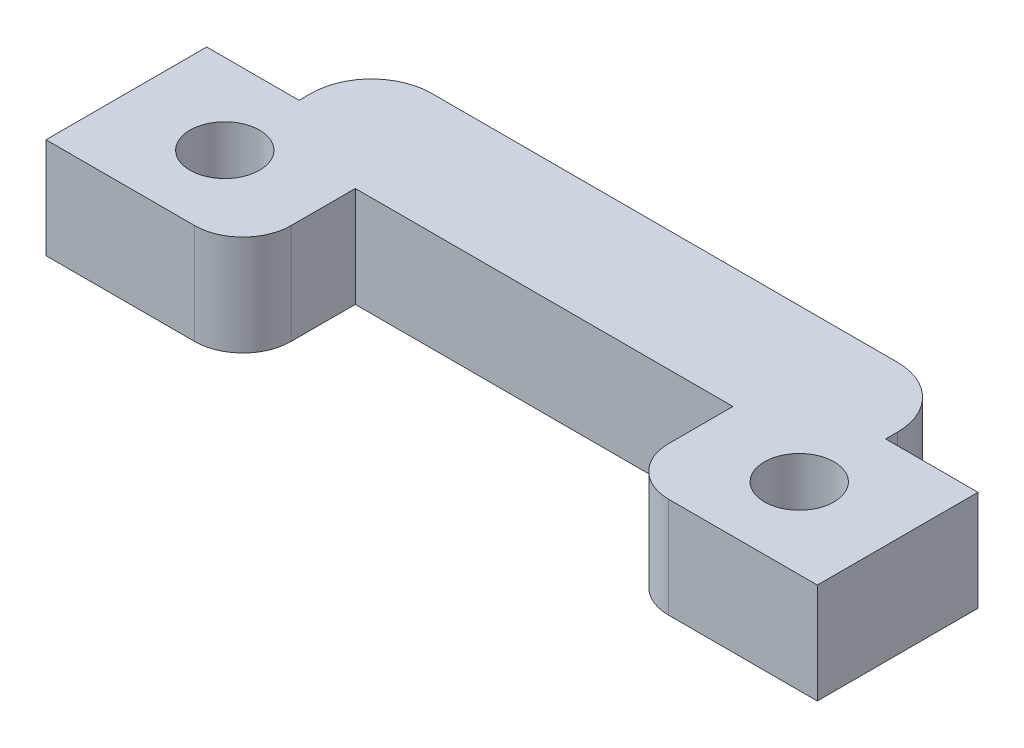
ISO-10303-21;
HEADER;
FILE_DESCRIPTION(('STEP AP214'),'2;1');
FILE_NAME('part.step','',(''),(''),'','','');
FILE_SCHEMA(('AUTOMOTIVE_DESIGN { 1 0 10303 214 1 1 1 1 }'));
ENDSEC;
DATA;
#1=APPLICATION_CONTEXT('core data for automotive mechanical design processes');
#2=APPLICATION_PROTOCOL_DEFINITION('international standard','automotive_design',2000,#1);
#3=PRODUCT_CONTEXT('',#1,'mechanical');
#4=PRODUCT('Part','Part','',(#3));
#5=PRODUCT_RELATED_PRODUCT_CATEGORY('part','',(#4));
#6=PRODUCT_DEFINITION_FORMATION('','',#4);
#7=PRODUCT_DEFINITION_CONTEXT('part definition',#1,'design');
#8=PRODUCT_DEFINITION('design','',#6,#7);
#9=PRODUCT_DEFINITION_SHAPE('','',#8);
#10=(LENGTH_UNIT() NAMED_UNIT(*) SI_UNIT(.MILLI.,.METRE.));
#11=(NAMED_UNIT(*) PLANE_ANGLE_UNIT() SI_UNIT($,.RADIAN.));
#12=(NAMED_UNIT(*) SI_UNIT($,.STERADIAN.) SOLID_ANGLE_UNIT());
#13=UNCERTAINTY_MEASURE_WITH_UNIT(LENGTH_MEASURE(1.E-05),#10,'distance_accuracy_value','');
#14=(GEOMETRIC_REPRESENTATION_CONTEXT(3) GLOBAL_UNCERTAINTY_ASSIGNED_CONTEXT((#13)) GLOBAL_UNIT_ASSIGNED_CONTEXT((#10,
#11,#12)) REPRESENTATION_CONTEXT('',''));
#15=CARTESIAN_POINT('',(0.,0.,0.));
#16=DIRECTION('',(0.,0.,1.));
#17=DIRECTION('',(1.,0.,0.));
#18=AXIS2_PLACEMENT_3D('',#15,#16,#17);
#19=CARTESIAN_POINT('',(0.,3.175,-7.23880944748787));
#20=DIRECTION('',(1.,0.,0.));
#21=DIRECTION('',(0.,0.,-1.));
#22=AXIS2_PLACEMENT_3D('',#19,#20,#21);
#23=PLANE('',#22);
#24=DIRECTION('',(0.,0.,1.));
#25=VECTOR('',#24,1.);
#26=CARTESIAN_POINT('',(0.,3.175,-7.23880944748787));
#27=LINE('',#26,#25);
#28=CARTESIAN_POINT('',(0.,3.175,-4.95280944748787));
#29=VERTEX_POINT('',#28);
#30=CARTESIAN_POINT('',(0.,3.175,0.127190552512133));
#31=VERTEX_POINT('',#30);
#32=EDGE_CURVE('E200',#29,#31,#27,.T.);
#33=ORIENTED_EDGE('',*,*,#32,.F.);
#34=DIRECTION('',(0.,-1.,0.));
#35=VECTOR('',#34,1.);
#36=CARTESIAN_POINT('',(0.,3.175,-4.95280944748787));
#37=LINE('',#36,#35);
#38=CARTESIAN_POINT('',(0.,0.,-4.95280944748787));
#39=VERTEX_POINT('',#38);
#40=EDGE_CURVE('E265',#29,#39,#37,.T.);
#41=ORIENTED_EDGE('',*,*,#40,.T.);
#42=DIRECTION('',(0.,0.,1.));
#43=VECTOR('',#42,1.);
#44=CARTESIAN_POINT('',(0.,0.,-7.23880944748787));
#45=LINE('',#44,#43);
#46=CARTESIAN_POINT('',(0.,0.,0.127190552512133));
#47=VERTEX_POINT('',#46);
#48=EDGE_CURVE('E180',#39,#47,#45,.T.);
#49=ORIENTED_EDGE('',*,*,#48,.T.);
#50=DIRECTION('',(0.,-1.,0.));
#51=VECTOR('',#50,1.);
#52=CARTESIAN_POINT('',(0.,3.175,0.127190552512133));
#53=LINE('',#52,#51);
#54=EDGE_CURVE('E220',#31,#47,#53,.T.);
#55=ORIENTED_EDGE('',*,*,#54,.F.);
#56=EDGE_LOOP('',(#33,#41,#49,#55));
#57=FACE_BOUND('',#56,.T.);
#58=ADVANCED_FACE('F32',(#57),#23,.F.);
#59=CARTESIAN_POINT('',(0.,3.175,0.127190552512133));
#60=DIRECTION('',(0.,0.,-1.));
#61=DIRECTION('',(-1.,0.,0.));
#62=AXIS2_PLACEMENT_3D('',#59,#60,#61);
#63=PLANE('',#62);
#64=DIRECTION('',(1.,0.,0.));
#65=VECTOR('',#64,1.);
#66=CARTESIAN_POINT('',(0.,0.,0.127190552512133));
#67=LINE('',#66,#65);
#68=CARTESIAN_POINT('',(4.69899999999999,0.,0.127190552512133));
#69=VERTEX_POINT('',#68);
#70=EDGE_CURVE('E182',#47,#69,#67,.T.);
#71=ORIENTED_EDGE('',*,*,#70,.T.);
#72=DIRECTION('',(0.,-1.,0.));
#73=VECTOR('',#72,1.);
#74=CARTESIAN_POINT('',(4.69899999999999,3.175,0.127190552512133));
#75=LINE('',#74,#73);
#76=CARTESIAN_POINT('',(4.69899999999999,3.175,0.127190552512133));
#77=VERTEX_POINT('',#76);
#78=EDGE_CURVE('E217',#77,#69,#75,.T.);
#79=ORIENTED_EDGE('',*,*,#78,.F.);
#80=DIRECTION('',(1.,0.,0.));
#81=VECTOR('',#80,1.);
#82=CARTESIAN_POINT('',(0.,3.175,0.127190552512133));
#83=LINE('',#82,#81);
#84=EDGE_CURVE('E288',#31,#77,#83,.T.);
#85=ORIENTED_EDGE('',*,*,#84,.F.);
#86=ORIENTED_EDGE('',*,*,#54,.T.);
#87=EDGE_LOOP('',(#71,#79,#85,#86));
#88=FACE_BOUND('',#87,.T.);
#89=ADVANCED_FACE('F330',(#88),#63,.F.);
#90=CARTESIAN_POINT('',(4.69899999999999,3.175,-1.39680944748787));
#91=DIRECTION('',(0.,-1.,0.));
#92=DIRECTION('',(0.,0.,-1.));
#93=AXIS2_PLACEMENT_3D('',#90,#91,#92);
#94=CYLINDRICAL_SURFACE('',#93,1.524);
#95=CARTESIAN_POINT('',(4.69899999999999,0.,-1.39680944748787));
#96=DIRECTION('',(0.,1.,0.));
#97=DIRECTION('',(0.,0.,1.));
#98=AXIS2_PLACEMENT_3D('',#95,#96,#97);
#99=CIRCLE('',#98,1.524);
#100=CARTESIAN_POINT('',(6.22299999999999,0.,-1.39680944748787));
#101=VERTEX_POINT('',#100);
#102=EDGE_CURVE('E185',#69,#101,#99,.T.);
#103=ORIENTED_EDGE('',*,*,#102,.T.);
#104=DIRECTION('',(0.,-1.,0.));
#105=VECTOR('',#104,1.);
#106=CARTESIAN_POINT('',(6.22299999999999,3.175,-1.39680944748787));
#107=LINE('',#106,#105);
#108=CARTESIAN_POINT('',(6.22299999999999,3.175,-1.39680944748787));
#109=VERTEX_POINT('',#108);
#110=EDGE_CURVE('E214',#109,#101,#107,.T.);
#111=ORIENTED_EDGE('',*,*,#110,.F.);
#112=CARTESIAN_POINT('',(4.69899999999999,3.175,-1.39680944748787));
#113=DIRECTION('',(0.,1.,0.));
#114=DIRECTION('',(0.,0.,1.));
#115=AXIS2_PLACEMENT_3D('',#112,#113,#114);
#116=CIRCLE('',#115,1.524);
#117=EDGE_CURVE('E290',#77,#109,#116,.T.);
#118=ORIENTED_EDGE('',*,*,#117,.F.);
#119=ORIENTED_EDGE('',*,*,#78,.T.);
#120=EDGE_LOOP('',(#103,#111,#118,#119));
#121=FACE_BOUND('',#120,.T.);
#122=ADVANCED_FACE('F325',(#121),#94,.T.);
#123=CARTESIAN_POINT('',(6.22299999999999,3.175,-3.42880944748787));
#124=DIRECTION('',(-1.,0.,0.));
#125=DIRECTION('',(0.,0.,1.));
#126=AXIS2_PLACEMENT_3D('',#123,#124,#125);
#127=PLANE('',#126);
#128=DIRECTION('',(0.,0.,-1.));
#129=VECTOR('',#128,1.);
#130=CARTESIAN_POINT('',(6.22299999999999,0.,-3.42880944748787));
#131=LINE('',#130,#129);
#132=CARTESIAN_POINT('',(6.22299999999999,0.,-3.42880944748787));
#133=VERTEX_POINT('',#132);
#134=EDGE_CURVE('E187',#101,#133,#131,.T.);
#135=ORIENTED_EDGE('',*,*,#134,.T.);
#136=DIRECTION('',(0.,-1.,0.));
#137=VECTOR('',#136,1.);
#138=CARTESIAN_POINT('',(6.22299999999999,3.175,-3.42880944748787));
#139=LINE('',#138,#137);
#140=CARTESIAN_POINT('',(6.22299999999999,3.175,-3.42880944748787));
#141=VERTEX_POINT('',#140);
#142=EDGE_CURVE('E211',#141,#133,#139,.T.);
#143=ORIENTED_EDGE('',*,*,#142,.F.);
#144=DIRECTION('',(0.,0.,-1.));
#145=VECTOR('',#144,1.);
#146=CARTESIAN_POINT('',(6.22299999999999,3.175,-3.42880944748787));
#147=LINE('',#146,#145);
#148=EDGE_CURVE('E292',#109,#141,#147,.T.);
#149=ORIENTED_EDGE('',*,*,#148,.F.);
#150=ORIENTED_EDGE('',*,*,#110,.T.);
#151=EDGE_LOOP('',(#135,#143,#149,#150));
#152=FACE_BOUND('',#151,.T.);
#153=ADVANCED_FACE('F319',(#152),#127,.F.);
#154=CARTESIAN_POINT('',(18.161,3.175,-3.42880944748787));
#155=DIRECTION('',(0.,0.,-1.));
#156=DIRECTION('',(-1.,0.,0.));
#157=AXIS2_PLACEMENT_3D('',#154,#155,#156);
#158=PLANE('',#157);
#159=DIRECTION('',(1.,0.,0.));
#160=VECTOR('',#159,1.);
#161=CARTESIAN_POINT('',(18.161,0.,-3.42880944748787));
#162=LINE('',#161,#160);
#163=CARTESIAN_POINT('',(18.161,0.,-3.42880944748787));
#164=VERTEX_POINT('',#163);
#165=EDGE_CURVE('E189',#133,#164,#162,.T.);
#166=ORIENTED_EDGE('',*,*,#165,.T.);
#167=DIRECTION('',(0.,-1.,0.));
#168=VECTOR('',#167,1.);
#169=CARTESIAN_POINT('',(18.161,3.175,-3.42880944748787));
#170=LINE('',#169,#168);
#171=CARTESIAN_POINT('',(18.161,3.175,-3.42880944748787));
#172=VERTEX_POINT('',#171);
#173=EDGE_CURVE('E208',#172,#164,#170,.T.);
#174=ORIENTED_EDGE('',*,*,#173,.F.);
#175=DIRECTION('',(1.,0.,0.));
#176=VECTOR('',#175,1.);
#177=CARTESIAN_POINT('',(18.161,3.175,-3.42880944748787));
#178=LINE('',#177,#176);
#179=EDGE_CURVE('E294',#141,#172,#178,.T.);
#180=ORIENTED_EDGE('',*,*,#179,.F.);
#181=ORIENTED_EDGE('',*,*,#142,.T.);
#182=EDGE_LOOP('',(#166,#174,#180,#181));
#183=FACE_BOUND('',#182,.T.);
#184=ADVANCED_FACE('F315',(#183),#158,.F.);
#185=CARTESIAN_POINT('',(18.161,3.175,-1.39680944748787));
#186=DIRECTION('',(1.,0.,0.));
#187=DIRECTION('',(0.,0.,-1.));
#188=AXIS2_PLACEMENT_3D('',#185,#186,#187);
#189=PLANE('',#188);
#190=DIRECTION('',(0.,0.,1.));
#191=VECTOR('',#190,1.);
#192=CARTESIAN_POINT('',(18.161,0.,-1.39680944748787));
#193=LINE('',#192,#191);
#194=CARTESIAN_POINT('',(18.161,0.,-1.39680944748787));
#195=VERTEX_POINT('',#194);
#196=EDGE_CURVE('E191',#164,#195,#193,.T.);
#197=ORIENTED_EDGE('',*,*,#196,.T.);
#198=DIRECTION('',(0.,-1.,0.));
#199=VECTOR('',#198,1.);
#200=CARTESIAN_POINT('',(18.161,3.175,-1.39680944748787));
#201=LINE('',#200,#199);
#202=CARTESIAN_POINT('',(18.161,3.175,-1.39680944748787));
#203=VERTEX_POINT('',#202);
#204=EDGE_CURVE('E205',#203,#195,#201,.T.);
#205=ORIENTED_EDGE('',*,*,#204,.F.);
#206=DIRECTION('',(0.,0.,1.));
#207=VECTOR('',#206,1.);
#208=CARTESIAN_POINT('',(18.161,3.175,-1.39680944748787));
#209=LINE('',#208,#207);
#210=EDGE_CURVE('E296',#172,#203,#209,.T.);
#211=ORIENTED_EDGE('',*,*,#210,.F.);
#212=ORIENTED_EDGE('',*,*,#173,.T.);
#213=EDGE_LOOP('',(#197,#205,#211,#212));
#214=FACE_BOUND('',#213,.T.);
#215=ADVANCED_FACE('F311',(#214),#189,.F.);
#216=CARTESIAN_POINT('',(19.685,3.175,-1.39680944748787));
#217=DIRECTION('',(0.,-1.,0.));
#218=DIRECTION('',(0.,0.,-1.));
#219=AXIS2_PLACEMENT_3D('',#216,#217,#218);
#220=CYLINDRICAL_SURFACE('',#219,1.524);
#221=CARTESIAN_POINT('',(19.685,0.,-1.39680944748787));
#222=DIRECTION('',(0.,1.,0.));
#223=DIRECTION('',(0.,0.,1.));
#224=AXIS2_PLACEMENT_3D('',#221,#222,#223);
#225=CIRCLE('',#224,1.524);
#226=CARTESIAN_POINT('',(19.685,0.,0.127190552512133));
#227=VERTEX_POINT('',#226);
#228=EDGE_CURVE('E193',#195,#227,#225,.T.);
#229=ORIENTED_EDGE('',*,*,#228,.T.);
#230=DIRECTION('',(0.,-1.,0.));
#231=VECTOR('',#230,1.);
#232=CARTESIAN_POINT('',(19.685,3.175,0.127190552512133));
#233=LINE('',#232,#231);
#234=CARTESIAN_POINT('',(19.685,3.175,0.127190552512133));
#235=VERTEX_POINT('',#234);
#236=EDGE_CURVE('E202',#235,#227,#233,.T.);
#237=ORIENTED_EDGE('',*,*,#236,.F.);
#238=CARTESIAN_POINT('',(19.685,3.175,-1.39680944748787));
#239=DIRECTION('',(0.,1.,0.));
#240=DIRECTION('',(0.,0.,1.));
#241=AXIS2_PLACEMENT_3D('',#238,#239,#240);
#242=CIRCLE('',#241,1.524);
#243=EDGE_CURVE('E176',#203,#235,#242,.T.);
#244=ORIENTED_EDGE('',*,*,#243,.F.);
#245=ORIENTED_EDGE('',*,*,#204,.T.);
#246=EDGE_LOOP('',(#229,#237,#244,#245));
#247=FACE_BOUND('',#246,.T.);
#248=ADVANCED_FACE('F302',(#247),#220,.T.);
#249=CARTESIAN_POINT('',(19.685,3.175,0.127190552512133));
#250=DIRECTION('',(0.,0.,-1.));
#251=DIRECTION('',(-1.,0.,0.));
#252=AXIS2_PLACEMENT_3D('',#249,#250,#251);
#253=PLANE('',#252);
#254=DIRECTION('',(1.,0.,0.));
#255=VECTOR('',#254,1.);
#256=CARTESIAN_POINT('',(19.685,0.,0.127190552512133));
#257=LINE('',#256,#255);
#258=CARTESIAN_POINT('',(24.384,0.,0.127190552512133));
#259=VERTEX_POINT('',#258);
#260=EDGE_CURVE('E195',#227,#259,#257,.T.);
#261=ORIENTED_EDGE('',*,*,#260,.T.);
#262=DIRECTION('',(0.,-1.,0.));
#263=VECTOR('',#262,1.);
#264=CARTESIAN_POINT('',(24.384,3.175,0.127190552512133));
#265=LINE('',#264,#263);
#266=CARTESIAN_POINT('',(24.384,3.175,0.127190552512133));
#267=VERTEX_POINT('',#266);
#268=EDGE_CURVE('E174',#267,#259,#265,.T.);
#269=ORIENTED_EDGE('',*,*,#268,.F.);
#270=DIRECTION('',(1.,0.,0.));
#271=VECTOR('',#270,1.);
#272=CARTESIAN_POINT('',(19.685,3.175,0.127190552512133));
#273=LINE('',#272,#271);
#274=EDGE_CURVE('E170',#235,#267,#273,.T.);
#275=ORIENTED_EDGE('',*,*,#274,.F.);
#276=ORIENTED_EDGE('',*,*,#236,.T.);
#277=EDGE_LOOP('',(#261,#269,#275,#276));
#278=FACE_BOUND('',#277,.T.);
#279=ADVANCED_FACE('F306',(#278),#253,.F.);
#280=CARTESIAN_POINT('',(24.384,3.175,0.127190552512133));
#281=DIRECTION('',(-1.,0.,0.));
#282=DIRECTION('',(0.,0.,1.));
#283=AXIS2_PLACEMENT_3D('',#280,#281,#282);
#284=PLANE('',#283);
#285=DIRECTION('',(0.,0.,-1.));
#286=VECTOR('',#285,1.);
#287=CARTESIAN_POINT('',(24.384,0.,0.127190552512133));
#288=LINE('',#287,#286);
#289=CARTESIAN_POINT('',(24.384,0.,-4.95280944748787));
#290=VERTEX_POINT('',#289);
#291=EDGE_CURVE('E165',#259,#290,#288,.T.);
#292=ORIENTED_EDGE('',*,*,#291,.T.);
#293=DIRECTION('',(0.,-1.,0.));
#294=VECTOR('',#293,1.);
#295=CARTESIAN_POINT('',(24.384,3.175,-4.95280944748787));
#296=LINE('',#295,#294);
#297=CARTESIAN_POINT('',(24.384,3.175,-4.95280944748787));
#298=VERTEX_POINT('',#297);
#299=EDGE_CURVE('E150',#298,#290,#296,.T.);
#300=ORIENTED_EDGE('',*,*,#299,.F.);
#301=DIRECTION('',(0.,0.,-1.));
#302=VECTOR('',#301,1.);
#303=CARTESIAN_POINT('',(24.384,3.175,0.127190552512133));
#304=LINE('',#303,#302);
#305=EDGE_CURVE('E163',#267,#298,#304,.T.);
#306=ORIENTED_EDGE('',*,*,#305,.F.);
#307=ORIENTED_EDGE('',*,*,#268,.T.);
#308=EDGE_LOOP('',(#292,#300,#306,#307));
#309=FACE_BOUND('',#308,.T.);
#310=ADVANCED_FACE('F161',(#309),#284,.F.);
#311=CARTESIAN_POINT('',(24.384,3.175,-7.23880944748787));
#312=DIRECTION('',(0.,0.,1.));
#313=DIRECTION('',(1.,0.,0.));
#314=AXIS2_PLACEMENT_3D('',#311,#312,#313);
#315=PLANE('',#314);
#316=DIRECTION('',(-1.,0.,0.));
#317=VECTOR('',#316,1.);
#318=CARTESIAN_POINT('',(24.384,0.,-7.23880944748787));
#319=LINE('',#318,#317);
#320=CARTESIAN_POINT('',(19.558,0.,-7.23880944748787));
#321=VERTEX_POINT('',#320);
#322=CARTESIAN_POINT('',(4.82599999999999,0.,-7.23880944748787));
#323=VERTEX_POINT('',#322);
#324=EDGE_CURVE('E198',#321,#323,#319,.T.);
#325=ORIENTED_EDGE('',*,*,#324,.T.);
#326=DIRECTION('',(0.,-1.,0.));
#327=VECTOR('',#326,1.);
#328=CARTESIAN_POINT('',(4.82599999999999,3.175,-7.23880944748787));
#329=LINE('',#328,#327);
#330=CARTESIAN_POINT('',(4.82599999999999,3.175,-7.23880944748787));
#331=VERTEX_POINT('',#330);
#332=EDGE_CURVE('E53',#323,#331,#329,.F.);
#333=ORIENTED_EDGE('',*,*,#332,.T.);
#334=DIRECTION('',(-1.,0.,0.));
#335=VECTOR('',#334,1.);
#336=CARTESIAN_POINT('',(24.384,3.175,-7.23880944748787));
#337=LINE('',#336,#335);
#338=CARTESIAN_POINT('',(19.558,3.175,-7.23880944748787));
#339=VERTEX_POINT('',#338);
#340=EDGE_CURVE('E172',#339,#331,#337,.T.);
#341=ORIENTED_EDGE('',*,*,#340,.F.);
#342=DIRECTION('',(0.,-1.,0.));
#343=VECTOR('',#342,1.);
#344=CARTESIAN_POINT('',(19.558,3.175,-7.23880944748787));
#345=LINE('',#344,#343);
#346=EDGE_CURVE('E230',#339,#321,#345,.T.);
#347=ORIENTED_EDGE('',*,*,#346,.T.);
#348=EDGE_LOOP('',(#325,#333,#341,#347));
#349=FACE_BOUND('',#348,.T.);
#350=ADVANCED_FACE('F257',(#349),#315,.F.);
#351=CARTESIAN_POINT('',(4.69899999999999,3.175,-1.39680944748787));
#352=DIRECTION('',(0.,1.,0.));
#353=DIRECTION('',(0.,0.,1.));
#354=AXIS2_PLACEMENT_3D('',#351,#352,#353);
#355=PLANE('',#354);
#356=ORIENTED_EDGE('',*,*,#340,.T.);
#357=CARTESIAN_POINT('',(4.82599999999999,3.175,-5.33380944748787));
#358=DIRECTION('',(0.,1.,0.));
#359=DIRECTION('',(0.,0.,1.));
#360=AXIS2_PLACEMENT_3D('',#357,#358,#359);
#361=CIRCLE('',#360,1.905);
#362=CARTESIAN_POINT('',(2.92099999999999,3.175,-5.33380944748787));
#363=VERTEX_POINT('',#362);
#364=EDGE_CURVE('E40',#331,#363,#361,.T.);
#365=ORIENTED_EDGE('',*,*,#364,.T.);
#366=DIRECTION('',(0.,0.,1.));
#367=VECTOR('',#366,1.);
#368=CARTESIAN_POINT('',(2.92099999999999,3.175,-7.23880944748787));
#369=LINE('',#368,#367);
#370=CARTESIAN_POINT('',(2.92099999999999,3.175,-4.95280944748787));
#371=VERTEX_POINT('',#370);
#372=EDGE_CURVE('E238',#363,#371,#369,.T.);
#373=ORIENTED_EDGE('',*,*,#372,.T.);
#374=DIRECTION('',(-1.,0.,0.));
#375=VECTOR('',#374,1.);
#376=CARTESIAN_POINT('',(0.,3.175,-4.95280944748787));
#377=LINE('',#376,#375);
#378=EDGE_CURVE('E248',#371,#29,#377,.T.);
#379=ORIENTED_EDGE('',*,*,#378,.T.);
#380=ORIENTED_EDGE('',*,*,#32,.T.);
#381=ORIENTED_EDGE('',*,*,#84,.T.);
#382=ORIENTED_EDGE('',*,*,#117,.T.);
#383=ORIENTED_EDGE('',*,*,#148,.T.);
#384=ORIENTED_EDGE('',*,*,#179,.T.);
#385=ORIENTED_EDGE('',*,*,#210,.T.);
#386=ORIENTED_EDGE('',*,*,#243,.T.);
#387=ORIENTED_EDGE('',*,*,#274,.T.);
#388=ORIENTED_EDGE('',*,*,#305,.T.);
#389=DIRECTION('',(-1.,0.,0.));
#390=VECTOR('',#389,1.);
#391=CARTESIAN_POINT('',(24.384,3.175,-4.95280944748787));
#392=LINE('',#391,#390);
#393=CARTESIAN_POINT('',(21.463,3.175,-4.95280944748787));
#394=VERTEX_POINT('',#393);
#395=EDGE_CURVE('E146',#298,#394,#392,.T.);
#396=ORIENTED_EDGE('',*,*,#395,.T.);
#397=DIRECTION('',(0.,0.,-1.));
#398=VECTOR('',#397,1.);
#399=CARTESIAN_POINT('',(21.463,3.175,-7.23880944748787));
#400=LINE('',#399,#398);
#401=CARTESIAN_POINT('',(21.463,3.175,-5.33380944748787));
#402=VERTEX_POINT('',#401);
#403=EDGE_CURVE('E155',#394,#402,#400,.T.);
#404=ORIENTED_EDGE('',*,*,#403,.T.);
#405=CARTESIAN_POINT('',(19.558,3.175,-5.33380944748787));
#406=DIRECTION('',(0.,1.,0.));
#407=DIRECTION('',(0.,0.,1.));
#408=AXIS2_PLACEMENT_3D('',#405,#406,#407);
#409=CIRCLE('',#408,1.905);
#410=EDGE_CURVE('E234',#402,#339,#409,.T.);
#411=ORIENTED_EDGE('',*,*,#410,.T.);
#412=EDGE_LOOP('',(#356,#365,#373,#379,#380,#381,#382,#383,#384,#385,#386,#387,#388,#396,#404,#411));
#413=FACE_BOUND('',#412,.T.);
#414=CARTESIAN_POINT('',(3.11149999999998,3.175,-2.41280944748787));
#415=DIRECTION('',(0.,-1.,0.));
#416=DIRECTION('',(0.,0.,-1.));
#417=AXIS2_PLACEMENT_3D('',#414,#415,#416);
#418=CIRCLE('',#417,1.1);
#419=CARTESIAN_POINT('',(3.11149999999998,3.175,-3.51280944748787));
#420=VERTEX_POINT('',#419);
#421=EDGE_CURVE('E279',#420,#420,#418,.T.);
#422=ORIENTED_EDGE('',*,*,#421,.T.);
#423=EDGE_LOOP('',(#422));
#424=FACE_BOUND('',#423,.T.);
#425=CARTESIAN_POINT('',(21.2725,3.175,-2.41280944748787));
#426=DIRECTION('',(0.,-1.,0.));
#427=DIRECTION('',(0.,0.,-1.));
#428=AXIS2_PLACEMENT_3D('',#425,#426,#427);
#429=CIRCLE('',#428,1.1);
#430=CARTESIAN_POINT('',(21.2725,3.175,-3.51280944748787));
#431=VERTEX_POINT('',#430);
#432=EDGE_CURVE('E183',#431,#431,#429,.T.);
#433=ORIENTED_EDGE('',*,*,#432,.T.);
#434=EDGE_LOOP('',(#433));
#435=FACE_BOUND('',#434,.T.);
#436=ADVANCED_FACE('F167',(#413,#424,#435),#355,.T.);
#437=CARTESIAN_POINT('',(4.69899999999999,0.,-1.39680944748787));
#438=DIRECTION('',(0.,1.,0.));
#439=DIRECTION('',(0.,0.,1.));
#440=AXIS2_PLACEMENT_3D('',#437,#438,#439);
#441=PLANE('',#440);
#442=CARTESIAN_POINT('',(3.11149999999998,0.,-2.41280944748787));
#443=DIRECTION('',(0.,-1.,0.));
#444=DIRECTION('',(0.,0.,-1.));
#445=AXIS2_PLACEMENT_3D('',#442,#443,#444);
#446=CIRCLE('',#445,1.1);
#447=CARTESIAN_POINT('',(3.11149999999998,0.,-3.51280944748787));
#448=VERTEX_POINT('',#447);
#449=EDGE_CURVE('E269',#448,#448,#446,.T.);
#450=ORIENTED_EDGE('',*,*,#449,.F.);
#451=EDGE_LOOP('',(#450));
#452=FACE_BOUND('',#451,.T.);
#453=CARTESIAN_POINT('',(21.2725,0.,-2.41280944748787));
#454=DIRECTION('',(0.,-1.,0.));
#455=DIRECTION('',(0.,0.,-1.));
#456=AXIS2_PLACEMENT_3D('',#453,#454,#455);
#457=CIRCLE('',#456,1.1);
#458=CARTESIAN_POINT('',(21.2725,0.,-3.51280944748787));
#459=VERTEX_POINT('',#458);
#460=EDGE_CURVE('E282',#459,#459,#457,.T.);
#461=ORIENTED_EDGE('',*,*,#460,.F.);
#462=EDGE_LOOP('',(#461));
#463=FACE_BOUND('',#462,.T.);
#464=DIRECTION('',(0.,0.,1.));
#465=VECTOR('',#464,1.);
#466=CARTESIAN_POINT('',(2.92099999999999,0.,-7.23880944748787));
#467=LINE('',#466,#465);
#468=CARTESIAN_POINT('',(2.92099999999999,0.,-5.33380944748787));
#469=VERTEX_POINT('',#468);
#470=CARTESIAN_POINT('',(2.92099999999999,0.,-4.95280944748787));
#471=VERTEX_POINT('',#470);
#472=EDGE_CURVE('E256',#469,#471,#467,.T.);
#473=ORIENTED_EDGE('',*,*,#472,.F.);
#474=CARTESIAN_POINT('',(4.82599999999999,0.,-5.33380944748787));
#475=DIRECTION('',(0.,1.,0.));
#476=DIRECTION('',(0.,0.,1.));
#477=AXIS2_PLACEMENT_3D('',#474,#475,#476);
#478=CIRCLE('',#477,1.905);
#479=EDGE_CURVE('E228',#469,#323,#478,.F.);
#480=ORIENTED_EDGE('',*,*,#479,.T.);
#481=ORIENTED_EDGE('',*,*,#324,.F.);
#482=CARTESIAN_POINT('',(19.558,0.,-5.33380944748787));
#483=DIRECTION('',(0.,1.,0.));
#484=DIRECTION('',(0.,0.,1.));
#485=AXIS2_PLACEMENT_3D('',#482,#483,#484);
#486=CIRCLE('',#485,1.905);
#487=CARTESIAN_POINT('',(21.463,0.,-5.33380944748787));
#488=VERTEX_POINT('',#487);
#489=EDGE_CURVE('E226',#321,#488,#486,.F.);
#490=ORIENTED_EDGE('',*,*,#489,.T.);
#491=DIRECTION('',(0.,0.,-1.));
#492=VECTOR('',#491,1.);
#493=CARTESIAN_POINT('',(21.463,0.,-7.23880944748787));
#494=LINE('',#493,#492);
#495=CARTESIAN_POINT('',(21.463,0.,-4.95280944748787));
#496=VERTEX_POINT('',#495);
#497=EDGE_CURVE('E156',#496,#488,#494,.T.);
#498=ORIENTED_EDGE('',*,*,#497,.F.);
#499=DIRECTION('',(-1.,0.,0.));
#500=VECTOR('',#499,1.);
#501=CARTESIAN_POINT('',(24.384,0.,-4.95280944748787));
#502=LINE('',#501,#500);
#503=EDGE_CURVE('E263',#290,#496,#502,.T.);
#504=ORIENTED_EDGE('',*,*,#503,.F.);
#505=ORIENTED_EDGE('',*,*,#291,.F.);
#506=ORIENTED_EDGE('',*,*,#260,.F.);
#507=ORIENTED_EDGE('',*,*,#228,.F.);
#508=ORIENTED_EDGE('',*,*,#196,.F.);
#509=ORIENTED_EDGE('',*,*,#165,.F.);
#510=ORIENTED_EDGE('',*,*,#134,.F.);
#511=ORIENTED_EDGE('',*,*,#102,.F.);
#512=ORIENTED_EDGE('',*,*,#70,.F.);
#513=ORIENTED_EDGE('',*,*,#48,.F.);
#514=DIRECTION('',(-1.,0.,0.));
#515=VECTOR('',#514,1.);
#516=CARTESIAN_POINT('',(0.,0.,-4.95280944748787));
#517=LINE('',#516,#515);
#518=EDGE_CURVE('E249',#471,#39,#517,.T.);
#519=ORIENTED_EDGE('',*,*,#518,.F.);
#520=EDGE_LOOP('',(#473,#480,#481,#490,#498,#504,#505,#506,#507,#508,#509,#510,#511,#512,#513,#519));
#521=FACE_BOUND('',#520,.T.);
#522=ADVANCED_FACE('F254',(#452,#463,#521),#441,.F.);
#523=CARTESIAN_POINT('',(21.2725,0.,-2.41280944748787));
#524=DIRECTION('',(0.,-1.,0.));
#525=DIRECTION('',(0.,0.,-1.));
#526=AXIS2_PLACEMENT_3D('',#523,#524,#525);
#527=CYLINDRICAL_SURFACE('',#526,1.1);
#528=ORIENTED_EDGE('',*,*,#432,.F.);
#529=EDGE_LOOP('',(#528));
#530=FACE_BOUND('',#529,.T.);
#531=ORIENTED_EDGE('',*,*,#460,.T.);
#532=EDGE_LOOP('',(#531));
#533=FACE_BOUND('',#532,.T.);
#534=ADVANCED_FACE('F344',(#530,#533),#527,.F.);
#535=CARTESIAN_POINT('',(3.11149999999998,0.,-2.41280944748787));
#536=DIRECTION('',(0.,-1.,0.));
#537=DIRECTION('',(0.,0.,-1.));
#538=AXIS2_PLACEMENT_3D('',#535,#536,#537);
#539=CYLINDRICAL_SURFACE('',#538,1.1);
#540=ORIENTED_EDGE('',*,*,#421,.F.);
#541=EDGE_LOOP('',(#540));
#542=FACE_BOUND('',#541,.T.);
#543=ORIENTED_EDGE('',*,*,#449,.T.);
#544=EDGE_LOOP('',(#543));
#545=FACE_BOUND('',#544,.T.);
#546=ADVANCED_FACE('F337',(#542,#545),#539,.F.);
#547=CARTESIAN_POINT('',(0.,3.175,-4.95280944748787));
#548=DIRECTION('',(0.,0.,1.));
#549=DIRECTION('',(1.,0.,0.));
#550=AXIS2_PLACEMENT_3D('',#547,#548,#549);
#551=PLANE('',#550);
#552=ORIENTED_EDGE('',*,*,#518,.T.);
#553=ORIENTED_EDGE('',*,*,#40,.F.);
#554=ORIENTED_EDGE('',*,*,#378,.F.);
#555=DIRECTION('',(0.,-1.,0.));
#556=VECTOR('',#555,1.);
#557=CARTESIAN_POINT('',(2.92099999999999,3.175,-4.95280944748787));
#558=LINE('',#557,#556);
#559=EDGE_CURVE('E246',#371,#471,#558,.T.);
#560=ORIENTED_EDGE('',*,*,#559,.T.);
#561=EDGE_LOOP('',(#552,#553,#554,#560));
#562=FACE_BOUND('',#561,.T.);
#563=ADVANCED_FACE('F335',(#562),#551,.F.);
#564=CARTESIAN_POINT('',(2.92099999999999,3.175,-7.23880944748787));
#565=DIRECTION('',(1.,0.,0.));
#566=DIRECTION('',(0.,0.,-1.));
#567=AXIS2_PLACEMENT_3D('',#564,#565,#566);
#568=PLANE('',#567);
#569=ORIENTED_EDGE('',*,*,#372,.F.);
#570=DIRECTION('',(0.,-1.,0.));
#571=VECTOR('',#570,1.);
#572=CARTESIAN_POINT('',(2.92099999999999,3.175,-5.33380944748787));
#573=LINE('',#572,#571);
#574=EDGE_CURVE('E223',#363,#469,#573,.T.);
#575=ORIENTED_EDGE('',*,*,#574,.T.);
#576=ORIENTED_EDGE('',*,*,#472,.T.);
#577=ORIENTED_EDGE('',*,*,#559,.F.);
#578=EDGE_LOOP('',(#569,#575,#576,#577));
#579=FACE_BOUND('',#578,.T.);
#580=ADVANCED_FACE('F243',(#579),#568,.F.);
#581=CARTESIAN_POINT('',(21.463,3.175,-7.23880944748787));
#582=DIRECTION('',(-1.,0.,0.));
#583=DIRECTION('',(0.,0.,1.));
#584=AXIS2_PLACEMENT_3D('',#581,#582,#583);
#585=PLANE('',#584);
#586=ORIENTED_EDGE('',*,*,#497,.T.);
#587=DIRECTION('',(0.,-1.,0.));
#588=VECTOR('',#587,1.);
#589=CARTESIAN_POINT('',(21.463,3.175,-5.33380944748787));
#590=LINE('',#589,#588);
#591=EDGE_CURVE('E11',#488,#402,#590,.F.);
#592=ORIENTED_EDGE('',*,*,#591,.T.);
#593=ORIENTED_EDGE('',*,*,#403,.F.);
#594=DIRECTION('',(0.,-1.,0.));
#595=VECTOR('',#594,1.);
#596=CARTESIAN_POINT('',(21.463,3.175,-4.95280944748787));
#597=LINE('',#596,#595);
#598=EDGE_CURVE('E152',#394,#496,#597,.T.);
#599=ORIENTED_EDGE('',*,*,#598,.T.);
#600=EDGE_LOOP('',(#586,#592,#593,#599));
#601=FACE_BOUND('',#600,.T.);
#602=ADVANCED_FACE('F262',(#601),#585,.F.);
#603=CARTESIAN_POINT('',(24.384,3.175,-4.95280944748787));
#604=DIRECTION('',(0.,0.,1.));
#605=DIRECTION('',(1.,0.,0.));
#606=AXIS2_PLACEMENT_3D('',#603,#604,#605);
#607=PLANE('',#606);
#608=ORIENTED_EDGE('',*,*,#503,.T.);
#609=ORIENTED_EDGE('',*,*,#598,.F.);
#610=ORIENTED_EDGE('',*,*,#395,.F.);
#611=ORIENTED_EDGE('',*,*,#299,.T.);
#612=EDGE_LOOP('',(#608,#609,#610,#611));
#613=FACE_BOUND('',#612,.T.);
#614=ADVANCED_FACE('F149',(#613),#607,.F.);
#615=CARTESIAN_POINT('',(4.82599999999999,3.175,-5.33380944748787));
#616=DIRECTION('',(0.,-1.,0.));
#617=DIRECTION('',(0.,0.,-1.));
#618=AXIS2_PLACEMENT_3D('',#615,#616,#617);
#619=CYLINDRICAL_SURFACE('',#618,1.905);
#620=ORIENTED_EDGE('',*,*,#364,.F.);
#621=ORIENTED_EDGE('',*,*,#332,.F.);
#622=ORIENTED_EDGE('',*,*,#479,.F.);
#623=ORIENTED_EDGE('',*,*,#574,.F.);
#624=EDGE_LOOP('',(#620,#621,#622,#623));
#625=FACE_BOUND('',#624,.T.);
#626=ADVANCED_FACE('F251',(#625),#619,.T.);
#627=CARTESIAN_POINT('',(19.558,3.175,-5.33380944748787));
#628=DIRECTION('',(0.,-1.,0.));
#629=DIRECTION('',(0.,0.,-1.));
#630=AXIS2_PLACEMENT_3D('',#627,#628,#629);
#631=CYLINDRICAL_SURFACE('',#630,1.905);
#632=ORIENTED_EDGE('',*,*,#410,.F.);
#633=ORIENTED_EDGE('',*,*,#591,.F.);
#634=ORIENTED_EDGE('',*,*,#489,.F.);
#635=ORIENTED_EDGE('',*,*,#346,.F.);
#636=EDGE_LOOP('',(#632,#633,#634,#635));
#637=FACE_BOUND('',#636,.T.);
#638=ADVANCED_FACE('F34',(#637),#631,.T.);
#639=CLOSED_SHELL('',(#58,#89,#122,#153,#184,#215,#248,#279,#310,#350,#436,#522,#534,#546,#563,
#580,#602,#614,#626,#638));
#640=MANIFOLD_SOLID_BREP('B2',#639);
#641=ADVANCED_BREP_SHAPE_REPRESENTATION('',(#18,#640),#14);
#642=SHAPE_DEFINITION_REPRESENTATION(#9,#641);
ENDSEC;
END-ISO-10303-21;
